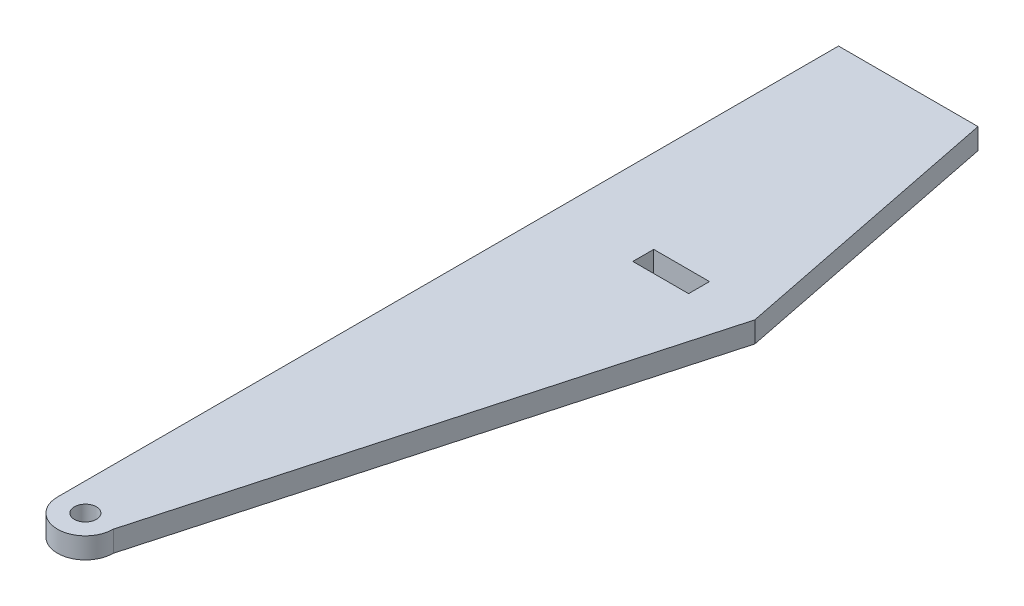
ISO-10303-21;
HEADER;
FILE_DESCRIPTION(('STEP AP214'),'2;1');
FILE_NAME('part.step','',(''),(''),'','','');
FILE_SCHEMA(('AUTOMOTIVE_DESIGN { 1 0 10303 214 1 1 1 1 }'));
ENDSEC;
DATA;
#1=APPLICATION_CONTEXT('core data for automotive mechanical design processes');
#2=APPLICATION_PROTOCOL_DEFINITION('international standard','automotive_design',2000,#1);
#3=PRODUCT_CONTEXT('',#1,'mechanical');
#4=PRODUCT('Part','Part','',(#3));
#5=PRODUCT_RELATED_PRODUCT_CATEGORY('part','',(#4));
#6=PRODUCT_DEFINITION_FORMATION('','',#4);
#7=PRODUCT_DEFINITION_CONTEXT('part definition',#1,'design');
#8=PRODUCT_DEFINITION('design','',#6,#7);
#9=PRODUCT_DEFINITION_SHAPE('','',#8);
#10=(LENGTH_UNIT() NAMED_UNIT(*) SI_UNIT(.MILLI.,.METRE.));
#11=(NAMED_UNIT(*) PLANE_ANGLE_UNIT() SI_UNIT($,.RADIAN.));
#12=(NAMED_UNIT(*) SI_UNIT($,.STERADIAN.) SOLID_ANGLE_UNIT());
#13=UNCERTAINTY_MEASURE_WITH_UNIT(LENGTH_MEASURE(1.E-05),#10,'distance_accuracy_value','');
#14=(GEOMETRIC_REPRESENTATION_CONTEXT(3) GLOBAL_UNCERTAINTY_ASSIGNED_CONTEXT((#13)) GLOBAL_UNIT_ASSIGNED_CONTEXT((#10,
#11,#12)) REPRESENTATION_CONTEXT('',''));
#15=CARTESIAN_POINT('',(0.,0.,0.));
#16=DIRECTION('',(0.,0.,1.));
#17=DIRECTION('',(1.,0.,0.));
#18=AXIS2_PLACEMENT_3D('',#15,#16,#17);
#19=CARTESIAN_POINT('',(0.,19.05,0.));
#20=DIRECTION('',(0.,1.,0.));
#21=DIRECTION('',(0.,0.,1.));
#22=AXIS2_PLACEMENT_3D('',#19,#20,#21);
#23=PLANE('',#22);
#24=CARTESIAN_POINT('',(0.,19.05,0.));
#25=DIRECTION('',(0.,1.,0.));
#26=DIRECTION('',(0.,0.,1.));
#27=AXIS2_PLACEMENT_3D('',#24,#25,#26);
#28=CIRCLE('',#27,10.);
#29=CARTESIAN_POINT('',(0.,19.05,10.));
#30=VERTEX_POINT('',#29);
#31=EDGE_CURVE('E142',#30,#30,#28,.T.);
#32=ORIENTED_EDGE('',*,*,#31,.F.);
#33=EDGE_LOOP('',(#32));
#34=FACE_BOUND('',#33,.T.);
#35=CARTESIAN_POINT('',(0.,19.05,0.));
#36=DIRECTION('',(0.,1.,0.));
#37=DIRECTION('',(0.,0.,1.));
#38=AXIS2_PLACEMENT_3D('',#35,#36,#37);
#39=CIRCLE('',#38,25.4);
#40=CARTESIAN_POINT('',(-25.4,19.05,0.));
#41=VERTEX_POINT('',#40);
#42=CARTESIAN_POINT('',(25.4,19.05,0.));
#43=VERTEX_POINT('',#42);
#44=EDGE_CURVE('E148',#41,#43,#39,.T.);
#45=ORIENTED_EDGE('',*,*,#44,.T.);
#46=DIRECTION('',(0.267643863786095,0.,-0.963517909629941));
#47=VECTOR('',#46,1.);
#48=CARTESIAN_POINT('',(152.4,19.05,-457.2));
#49=LINE('',#48,#47);
#50=CARTESIAN_POINT('',(152.4,19.05,-457.2));
#51=VERTEX_POINT('',#50);
#52=EDGE_CURVE('E151',#43,#51,#49,.T.);
#53=ORIENTED_EDGE('',*,*,#52,.T.);
#54=DIRECTION('',(-0.196116135138184,0.,-0.98058067569092));
#55=VECTOR('',#54,1.);
#56=CARTESIAN_POINT('',(101.6,19.05,-711.2));
#57=LINE('',#56,#55);
#58=CARTESIAN_POINT('',(101.6,19.05,-711.2));
#59=VERTEX_POINT('',#58);
#60=EDGE_CURVE('E154',#51,#59,#57,.T.);
#61=ORIENTED_EDGE('',*,*,#60,.T.);
#62=DIRECTION('',(-1.,0.,0.));
#63=VECTOR('',#62,1.);
#64=CARTESIAN_POINT('',(-25.4,19.05,-711.2));
#65=LINE('',#64,#63);
#66=CARTESIAN_POINT('',(-25.4,19.05,-711.2));
#67=VERTEX_POINT('',#66);
#68=EDGE_CURVE('E156',#59,#67,#65,.T.);
#69=ORIENTED_EDGE('',*,*,#68,.T.);
#70=DIRECTION('',(0.,0.,1.));
#71=VECTOR('',#70,1.);
#72=CARTESIAN_POINT('',(-25.4,19.05,0.));
#73=LINE('',#72,#71);
#74=EDGE_CURVE('E158',#67,#41,#73,.T.);
#75=ORIENTED_EDGE('',*,*,#74,.T.);
#76=EDGE_LOOP('',(#45,#53,#61,#69,#75));
#77=FACE_BOUND('',#76,.T.);
#78=DIRECTION('',(-1.,0.,0.));
#79=VECTOR('',#78,1.);
#80=CARTESIAN_POINT('',(50.8,19.05,-466.725));
#81=LINE('',#80,#79);
#82=CARTESIAN_POINT('',(101.6,19.05,-466.725));
#83=VERTEX_POINT('',#82);
#84=CARTESIAN_POINT('',(50.8,19.05,-466.725));
#85=VERTEX_POINT('',#84);
#86=EDGE_CURVE('E114',#83,#85,#81,.T.);
#87=ORIENTED_EDGE('',*,*,#86,.F.);
#88=DIRECTION('',(0.,0.,-1.));
#89=VECTOR('',#88,1.);
#90=CARTESIAN_POINT('',(101.6,19.05,-447.675));
#91=LINE('',#90,#89);
#92=CARTESIAN_POINT('',(101.6,19.05,-447.675));
#93=VERTEX_POINT('',#92);
#94=EDGE_CURVE('E106',#93,#83,#91,.T.);
#95=ORIENTED_EDGE('',*,*,#94,.F.);
#96=DIRECTION('',(1.,0.,0.));
#97=VECTOR('',#96,1.);
#98=CARTESIAN_POINT('',(50.8,19.05,-447.675));
#99=LINE('',#98,#97);
#100=CARTESIAN_POINT('',(50.8,19.05,-447.675));
#101=VERTEX_POINT('',#100);
#102=EDGE_CURVE('E128',#101,#93,#99,.T.);
#103=ORIENTED_EDGE('',*,*,#102,.F.);
#104=DIRECTION('',(0.,0.,1.));
#105=VECTOR('',#104,1.);
#106=CARTESIAN_POINT('',(50.8,19.05,-447.675));
#107=LINE('',#106,#105);
#108=EDGE_CURVE('E126',#85,#101,#107,.T.);
#109=ORIENTED_EDGE('',*,*,#108,.F.);
#110=EDGE_LOOP('',(#87,#95,#103,#109));
#111=FACE_BOUND('',#110,.T.);
#112=ADVANCED_FACE('F35',(#34,#77,#111),#23,.T.);
#113=CARTESIAN_POINT('',(0.,0.,0.));
#114=DIRECTION('',(0.,1.,0.));
#115=DIRECTION('',(0.,0.,1.));
#116=AXIS2_PLACEMENT_3D('',#113,#114,#115);
#117=PLANE('',#116);
#118=CARTESIAN_POINT('',(0.,0.,0.));
#119=DIRECTION('',(0.,1.,0.));
#120=DIRECTION('',(0.,0.,1.));
#121=AXIS2_PLACEMENT_3D('',#118,#119,#120);
#122=CIRCLE('',#121,10.);
#123=CARTESIAN_POINT('',(0.,0.,10.));
#124=VERTEX_POINT('',#123);
#125=EDGE_CURVE('E122',#124,#124,#122,.T.);
#126=ORIENTED_EDGE('',*,*,#125,.T.);
#127=EDGE_LOOP('',(#126));
#128=FACE_BOUND('',#127,.T.);
#129=CARTESIAN_POINT('',(0.,0.,0.));
#130=DIRECTION('',(0.,1.,0.));
#131=DIRECTION('',(0.,0.,1.));
#132=AXIS2_PLACEMENT_3D('',#129,#130,#131);
#133=CIRCLE('',#132,25.4);
#134=CARTESIAN_POINT('',(-25.4,0.,0.));
#135=VERTEX_POINT('',#134);
#136=CARTESIAN_POINT('',(25.4,0.,0.));
#137=VERTEX_POINT('',#136);
#138=EDGE_CURVE('E145',#135,#137,#133,.T.);
#139=ORIENTED_EDGE('',*,*,#138,.F.);
#140=DIRECTION('',(0.,0.,1.));
#141=VECTOR('',#140,1.);
#142=CARTESIAN_POINT('',(-25.4,0.,0.));
#143=LINE('',#142,#141);
#144=CARTESIAN_POINT('',(-25.4,0.,-711.2));
#145=VERTEX_POINT('',#144);
#146=EDGE_CURVE('E152',#145,#135,#143,.T.);
#147=ORIENTED_EDGE('',*,*,#146,.F.);
#148=DIRECTION('',(-1.,0.,0.));
#149=VECTOR('',#148,1.);
#150=CARTESIAN_POINT('',(-25.4,0.,-711.2));
#151=LINE('',#150,#149);
#152=CARTESIAN_POINT('',(101.6,0.,-711.2));
#153=VERTEX_POINT('',#152);
#154=EDGE_CURVE('E167',#153,#145,#151,.T.);
#155=ORIENTED_EDGE('',*,*,#154,.F.);
#156=DIRECTION('',(-0.196116135138184,0.,-0.98058067569092));
#157=VECTOR('',#156,1.);
#158=CARTESIAN_POINT('',(101.6,0.,-711.2));
#159=LINE('',#158,#157);
#160=CARTESIAN_POINT('',(152.4,0.,-457.2));
#161=VERTEX_POINT('',#160);
#162=EDGE_CURVE('E165',#161,#153,#159,.T.);
#163=ORIENTED_EDGE('',*,*,#162,.F.);
#164=DIRECTION('',(0.267643863786095,0.,-0.963517909629941));
#165=VECTOR('',#164,1.);
#166=CARTESIAN_POINT('',(152.4,0.,-457.2));
#167=LINE('',#166,#165);
#168=EDGE_CURVE('E163',#137,#161,#167,.T.);
#169=ORIENTED_EDGE('',*,*,#168,.F.);
#170=EDGE_LOOP('',(#139,#147,#155,#163,#169));
#171=FACE_BOUND('',#170,.T.);
#172=DIRECTION('',(0.,0.,-1.));
#173=VECTOR('',#172,1.);
#174=CARTESIAN_POINT('',(101.6,0.,-447.675));
#175=LINE('',#174,#173);
#176=CARTESIAN_POINT('',(101.6,0.,-447.675));
#177=VERTEX_POINT('',#176);
#178=CARTESIAN_POINT('',(101.6,0.,-466.725));
#179=VERTEX_POINT('',#178);
#180=EDGE_CURVE('E58',#177,#179,#175,.T.);
#181=ORIENTED_EDGE('',*,*,#180,.T.);
#182=DIRECTION('',(-1.,0.,0.));
#183=VECTOR('',#182,1.);
#184=CARTESIAN_POINT('',(50.8,0.,-466.725));
#185=LINE('',#184,#183);
#186=CARTESIAN_POINT('',(50.8,0.,-466.725));
#187=VERTEX_POINT('',#186);
#188=EDGE_CURVE('E121',#179,#187,#185,.T.);
#189=ORIENTED_EDGE('',*,*,#188,.T.);
#190=DIRECTION('',(0.,0.,1.));
#191=VECTOR('',#190,1.);
#192=CARTESIAN_POINT('',(50.8,0.,-447.675));
#193=LINE('',#192,#191);
#194=CARTESIAN_POINT('',(50.8,0.,-447.675));
#195=VERTEX_POINT('',#194);
#196=EDGE_CURVE('E134',#187,#195,#193,.T.);
#197=ORIENTED_EDGE('',*,*,#196,.T.);
#198=DIRECTION('',(1.,0.,0.));
#199=VECTOR('',#198,1.);
#200=CARTESIAN_POINT('',(50.8,0.,-447.675));
#201=LINE('',#200,#199);
#202=EDGE_CURVE('E115',#195,#177,#201,.T.);
#203=ORIENTED_EDGE('',*,*,#202,.T.);
#204=EDGE_LOOP('',(#181,#189,#197,#203));
#205=FACE_BOUND('',#204,.T.);
#206=ADVANCED_FACE('F188',(#128,#171,#205),#117,.F.);
#207=CARTESIAN_POINT('',(0.,19.05,0.));
#208=DIRECTION('',(0.,-1.,0.));
#209=DIRECTION('',(0.,0.,-1.));
#210=AXIS2_PLACEMENT_3D('',#207,#208,#209);
#211=CYLINDRICAL_SURFACE('',#210,25.4);
#212=ORIENTED_EDGE('',*,*,#138,.T.);
#213=DIRECTION('',(0.,-1.,0.));
#214=VECTOR('',#213,1.);
#215=CARTESIAN_POINT('',(25.4,19.05,0.));
#216=LINE('',#215,#214);
#217=EDGE_CURVE('E11',#43,#137,#216,.T.);
#218=ORIENTED_EDGE('',*,*,#217,.F.);
#219=ORIENTED_EDGE('',*,*,#44,.F.);
#220=DIRECTION('',(0.,-1.,0.));
#221=VECTOR('',#220,1.);
#222=CARTESIAN_POINT('',(-25.4,19.05,0.));
#223=LINE('',#222,#221);
#224=EDGE_CURVE('E160',#41,#135,#223,.T.);
#225=ORIENTED_EDGE('',*,*,#224,.T.);
#226=EDGE_LOOP('',(#212,#218,#219,#225));
#227=FACE_BOUND('',#226,.T.);
#228=ADVANCED_FACE('F37',(#227),#211,.T.);
#229=CARTESIAN_POINT('',(152.4,19.05,-457.2));
#230=DIRECTION('',(-0.963517909629941,0.,-0.267643863786095));
#231=DIRECTION('',(-0.267643863786095,0.,0.963517909629941));
#232=AXIS2_PLACEMENT_3D('',#229,#230,#231);
#233=PLANE('',#232);
#234=ORIENTED_EDGE('',*,*,#168,.T.);
#235=DIRECTION('',(0.,-1.,0.));
#236=VECTOR('',#235,1.);
#237=CARTESIAN_POINT('',(152.4,19.05,-457.2));
#238=LINE('',#237,#236);
#239=EDGE_CURVE('E43',#51,#161,#238,.T.);
#240=ORIENTED_EDGE('',*,*,#239,.F.);
#241=ORIENTED_EDGE('',*,*,#52,.F.);
#242=ORIENTED_EDGE('',*,*,#217,.T.);
#243=EDGE_LOOP('',(#234,#240,#241,#242));
#244=FACE_BOUND('',#243,.T.);
#245=ADVANCED_FACE('F202',(#244),#233,.F.);
#246=CARTESIAN_POINT('',(101.6,19.05,-711.2));
#247=DIRECTION('',(-0.98058067569092,0.,0.196116135138184));
#248=DIRECTION('',(0.196116135138184,0.,0.98058067569092));
#249=AXIS2_PLACEMENT_3D('',#246,#247,#248);
#250=PLANE('',#249);
#251=ORIENTED_EDGE('',*,*,#162,.T.);
#252=DIRECTION('',(0.,-1.,0.));
#253=VECTOR('',#252,1.);
#254=CARTESIAN_POINT('',(101.6,19.05,-711.2));
#255=LINE('',#254,#253);
#256=EDGE_CURVE('E175',#59,#153,#255,.T.);
#257=ORIENTED_EDGE('',*,*,#256,.F.);
#258=ORIENTED_EDGE('',*,*,#60,.F.);
#259=ORIENTED_EDGE('',*,*,#239,.T.);
#260=EDGE_LOOP('',(#251,#257,#258,#259));
#261=FACE_BOUND('',#260,.T.);
#262=ADVANCED_FACE('F182',(#261),#250,.F.);
#263=CARTESIAN_POINT('',(-25.4,19.05,-711.2));
#264=DIRECTION('',(0.,0.,1.));
#265=DIRECTION('',(1.,0.,0.));
#266=AXIS2_PLACEMENT_3D('',#263,#264,#265);
#267=PLANE('',#266);
#268=ORIENTED_EDGE('',*,*,#154,.T.);
#269=DIRECTION('',(0.,-1.,0.));
#270=VECTOR('',#269,1.);
#271=CARTESIAN_POINT('',(-25.4,19.05,-711.2));
#272=LINE('',#271,#270);
#273=EDGE_CURVE('E172',#67,#145,#272,.T.);
#274=ORIENTED_EDGE('',*,*,#273,.F.);
#275=ORIENTED_EDGE('',*,*,#68,.F.);
#276=ORIENTED_EDGE('',*,*,#256,.T.);
#277=EDGE_LOOP('',(#268,#274,#275,#276));
#278=FACE_BOUND('',#277,.T.);
#279=ADVANCED_FACE('F193',(#278),#267,.F.);
#280=CARTESIAN_POINT('',(-25.4,19.05,0.));
#281=DIRECTION('',(1.,0.,0.));
#282=DIRECTION('',(0.,0.,-1.));
#283=AXIS2_PLACEMENT_3D('',#280,#281,#282);
#284=PLANE('',#283);
#285=ORIENTED_EDGE('',*,*,#146,.T.);
#286=ORIENTED_EDGE('',*,*,#224,.F.);
#287=ORIENTED_EDGE('',*,*,#74,.F.);
#288=ORIENTED_EDGE('',*,*,#273,.T.);
#289=EDGE_LOOP('',(#285,#286,#287,#288));
#290=FACE_BOUND('',#289,.T.);
#291=ADVANCED_FACE('F197',(#290),#284,.F.);
#292=CARTESIAN_POINT('',(0.,19.05,0.));
#293=DIRECTION('',(0.,-1.,0.));
#294=DIRECTION('',(0.,0.,-1.));
#295=AXIS2_PLACEMENT_3D('',#292,#293,#294);
#296=CYLINDRICAL_SURFACE('',#295,10.);
#297=ORIENTED_EDGE('',*,*,#31,.T.);
#298=EDGE_LOOP('',(#297));
#299=FACE_BOUND('',#298,.T.);
#300=ORIENTED_EDGE('',*,*,#125,.F.);
#301=EDGE_LOOP('',(#300));
#302=FACE_BOUND('',#301,.T.);
#303=ADVANCED_FACE('F218',(#299,#302),#296,.F.);
#304=CARTESIAN_POINT('',(101.6,19.05,-447.675));
#305=DIRECTION('',(-1.,0.,0.));
#306=DIRECTION('',(0.,0.,1.));
#307=AXIS2_PLACEMENT_3D('',#304,#305,#306);
#308=PLANE('',#307);
#309=ORIENTED_EDGE('',*,*,#180,.F.);
#310=DIRECTION('',(0.,-1.,0.));
#311=VECTOR('',#310,1.);
#312=CARTESIAN_POINT('',(101.6,19.05,-447.675));
#313=LINE('',#312,#311);
#314=EDGE_CURVE('E110',#93,#177,#313,.T.);
#315=ORIENTED_EDGE('',*,*,#314,.F.);
#316=ORIENTED_EDGE('',*,*,#94,.T.);
#317=DIRECTION('',(0.,-1.,0.));
#318=VECTOR('',#317,1.);
#319=CARTESIAN_POINT('',(101.6,19.05,-466.725));
#320=LINE('',#319,#318);
#321=EDGE_CURVE('E109',#83,#179,#320,.T.);
#322=ORIENTED_EDGE('',*,*,#321,.T.);
#323=EDGE_LOOP('',(#309,#315,#316,#322));
#324=FACE_BOUND('',#323,.T.);
#325=ADVANCED_FACE('F108',(#324),#308,.T.);
#326=CARTESIAN_POINT('',(50.8,19.05,-466.725));
#327=DIRECTION('',(0.,0.,1.));
#328=DIRECTION('',(1.,0.,0.));
#329=AXIS2_PLACEMENT_3D('',#326,#327,#328);
#330=PLANE('',#329);
#331=ORIENTED_EDGE('',*,*,#188,.F.);
#332=ORIENTED_EDGE('',*,*,#321,.F.);
#333=ORIENTED_EDGE('',*,*,#86,.T.);
#334=DIRECTION('',(0.,-1.,0.));
#335=VECTOR('',#334,1.);
#336=CARTESIAN_POINT('',(50.8,19.05,-466.725));
#337=LINE('',#336,#335);
#338=EDGE_CURVE('E123',#85,#187,#337,.T.);
#339=ORIENTED_EDGE('',*,*,#338,.T.);
#340=EDGE_LOOP('',(#331,#332,#333,#339));
#341=FACE_BOUND('',#340,.T.);
#342=ADVANCED_FACE('F118',(#341),#330,.T.);
#343=CARTESIAN_POINT('',(50.8,19.05,-447.675));
#344=DIRECTION('',(1.,0.,0.));
#345=DIRECTION('',(0.,0.,-1.));
#346=AXIS2_PLACEMENT_3D('',#343,#344,#345);
#347=PLANE('',#346);
#348=ORIENTED_EDGE('',*,*,#196,.F.);
#349=ORIENTED_EDGE('',*,*,#338,.F.);
#350=ORIENTED_EDGE('',*,*,#108,.T.);
#351=DIRECTION('',(0.,-1.,0.));
#352=VECTOR('',#351,1.);
#353=CARTESIAN_POINT('',(50.8,19.05,-447.675));
#354=LINE('',#353,#352);
#355=EDGE_CURVE('E50',#101,#195,#354,.T.);
#356=ORIENTED_EDGE('',*,*,#355,.T.);
#357=EDGE_LOOP('',(#348,#349,#350,#356));
#358=FACE_BOUND('',#357,.T.);
#359=ADVANCED_FACE('F255',(#358),#347,.T.);
#360=CARTESIAN_POINT('',(50.8,19.05,-447.675));
#361=DIRECTION('',(0.,0.,-1.));
#362=DIRECTION('',(-1.,0.,0.));
#363=AXIS2_PLACEMENT_3D('',#360,#361,#362);
#364=PLANE('',#363);
#365=ORIENTED_EDGE('',*,*,#202,.F.);
#366=ORIENTED_EDGE('',*,*,#355,.F.);
#367=ORIENTED_EDGE('',*,*,#102,.T.);
#368=ORIENTED_EDGE('',*,*,#314,.T.);
#369=EDGE_LOOP('',(#365,#366,#367,#368));
#370=FACE_BOUND('',#369,.T.);
#371=ADVANCED_FACE('F262',(#370),#364,.T.);
#372=CLOSED_SHELL('',(#112,#206,#228,#245,#262,#279,#291,#303,#325,#342,#359,#371));
#373=MANIFOLD_SOLID_BREP('B2',#372);
#374=ADVANCED_BREP_SHAPE_REPRESENTATION('',(#18,#373),#14);
#375=SHAPE_DEFINITION_REPRESENTATION(#9,#374);
ENDSEC;
END-ISO-10303-21;
